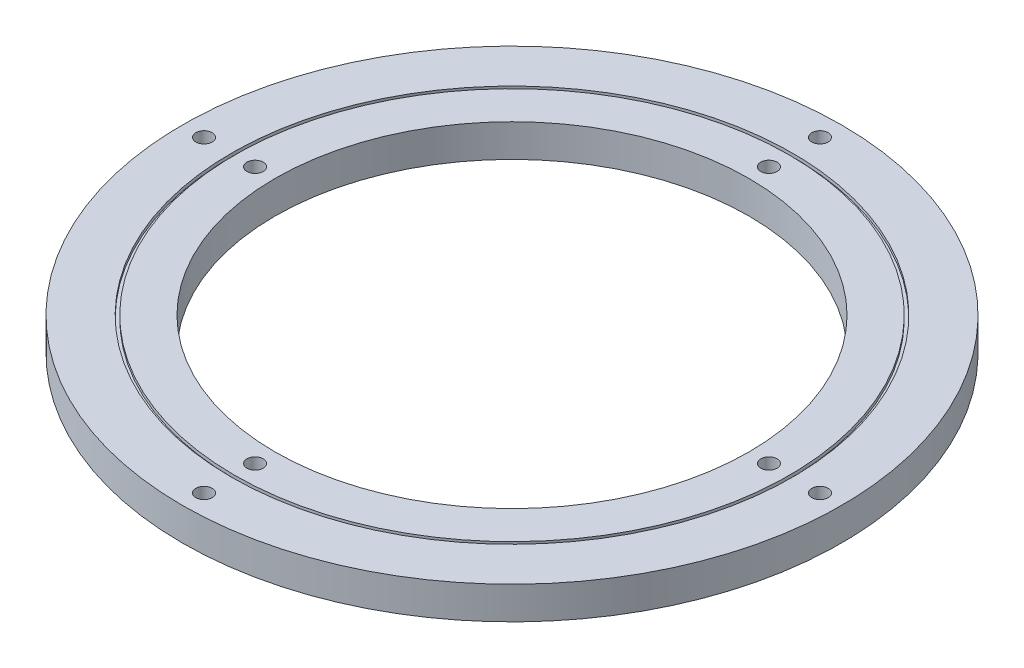
ISO-10303-21;
HEADER;
FILE_DESCRIPTION(('STEP AP214'),'2;1');
FILE_NAME('part.step','',(''),(''),'','','');
FILE_SCHEMA(('AUTOMOTIVE_DESIGN { 1 0 10303 214 1 1 1 1 }'));
ENDSEC;
DATA;
#1=APPLICATION_CONTEXT('core data for automotive mechanical design processes');
#2=APPLICATION_PROTOCOL_DEFINITION('international standard','automotive_design',2000,#1);
#3=PRODUCT_CONTEXT('',#1,'mechanical');
#4=PRODUCT('Part','Part','',(#3));
#5=PRODUCT_RELATED_PRODUCT_CATEGORY('part','',(#4));
#6=PRODUCT_DEFINITION_FORMATION('','',#4);
#7=PRODUCT_DEFINITION_CONTEXT('part definition',#1,'design');
#8=PRODUCT_DEFINITION('design','',#6,#7);
#9=PRODUCT_DEFINITION_SHAPE('','',#8);
#10=(LENGTH_UNIT() NAMED_UNIT(*) SI_UNIT(.MILLI.,.METRE.));
#11=(NAMED_UNIT(*) PLANE_ANGLE_UNIT() SI_UNIT($,.RADIAN.));
#12=(NAMED_UNIT(*) SI_UNIT($,.STERADIAN.) SOLID_ANGLE_UNIT());
#13=UNCERTAINTY_MEASURE_WITH_UNIT(LENGTH_MEASURE(1.E-05),#10,'distance_accuracy_value','');
#14=(GEOMETRIC_REPRESENTATION_CONTEXT(3) GLOBAL_UNCERTAINTY_ASSIGNED_CONTEXT((#13)) GLOBAL_UNIT_ASSIGNED_CONTEXT((#10,
#11,#12)) REPRESENTATION_CONTEXT('',''));
#15=CARTESIAN_POINT('',(0.,0.,0.));
#16=DIRECTION('',(0.,0.,1.));
#17=DIRECTION('',(1.,0.,0.));
#18=AXIS2_PLACEMENT_3D('',#15,#16,#17);
#19=CARTESIAN_POINT('',(0.,0.,0.));
#20=DIRECTION('',(0.,1.,0.));
#21=DIRECTION('',(0.,0.,1.));
#22=AXIS2_PLACEMENT_3D('',#19,#20,#21);
#23=PLANE('',#22);
#24=CARTESIAN_POINT('',(0.,0.,0.));
#25=DIRECTION('',(0.,1.,0.));
#26=DIRECTION('',(0.,0.,1.));
#27=AXIS2_PLACEMENT_3D('',#24,#25,#26);
#28=CIRCLE('',#27,72.6313);
#29=CARTESIAN_POINT('',(0.,0.,72.6313));
#30=VERTEX_POINT('',#29);
#31=EDGE_CURVE('E43',#30,#30,#28,.T.);
#32=ORIENTED_EDGE('',*,*,#31,.T.);
#33=EDGE_LOOP('',(#32));
#34=FACE_BOUND('',#33,.T.);
#35=CARTESIAN_POINT('',(2.64979010955457E-13,0.,-78.7635));
#36=DIRECTION('',(0.,1.,0.));
#37=DIRECTION('',(0.,0.,1.));
#38=AXIS2_PLACEMENT_3D('',#35,#36,#37);
#39=CIRCLE('',#38,2.50000000000001);
#40=CARTESIAN_POINT('',(2.64979010955457E-13,0.,-76.2635));
#41=VERTEX_POINT('',#40);
#42=EDGE_CURVE('E53',#41,#41,#39,.T.);
#43=ORIENTED_EDGE('',*,*,#42,.T.);
#44=EDGE_LOOP('',(#43));
#45=FACE_BOUND('',#44,.T.);
#46=CARTESIAN_POINT('',(-78.7635,0.,0.));
#47=DIRECTION('',(0.,1.,0.));
#48=DIRECTION('',(0.,0.,1.));
#49=AXIS2_PLACEMENT_3D('',#46,#47,#48);
#50=CIRCLE('',#49,2.50000000000001);
#51=CARTESIAN_POINT('',(-78.7635,0.,2.50000000000001));
#52=VERTEX_POINT('',#51);
#53=EDGE_CURVE('E59',#52,#52,#50,.T.);
#54=ORIENTED_EDGE('',*,*,#53,.T.);
#55=EDGE_LOOP('',(#54));
#56=FACE_BOUND('',#55,.T.);
#57=CARTESIAN_POINT('',(-8.13585310233123E-13,0.,78.7635));
#58=DIRECTION('',(0.,1.,0.));
#59=DIRECTION('',(0.,0.,1.));
#60=AXIS2_PLACEMENT_3D('',#57,#58,#59);
#61=CIRCLE('',#60,2.50000000000001);
#62=CARTESIAN_POINT('',(-8.13585310233123E-13,0.,81.2635));
#63=VERTEX_POINT('',#62);
#64=EDGE_CURVE('E79',#63,#63,#61,.T.);
#65=ORIENTED_EDGE('',*,*,#64,.T.);
#66=EDGE_LOOP('',(#65));
#67=FACE_BOUND('',#66,.T.);
#68=CARTESIAN_POINT('',(78.7635,0.,5.3776427755281E-13));
#69=DIRECTION('',(0.,1.,0.));
#70=DIRECTION('',(0.,0.,1.));
#71=AXIS2_PLACEMENT_3D('',#68,#69,#70);
#72=CIRCLE('',#71,2.50000000000001);
#73=CARTESIAN_POINT('',(78.7635,0.,2.50000000000055));
#74=VERTEX_POINT('',#73);
#75=EDGE_CURVE('E67',#74,#74,#72,.T.);
#76=ORIENTED_EDGE('',*,*,#75,.T.);
#77=EDGE_LOOP('',(#76));
#78=FACE_BOUND('',#77,.T.);
#79=CARTESIAN_POINT('',(0.,0.,0.));
#80=DIRECTION('',(0.,1.,0.));
#81=DIRECTION('',(0.,0.,1.));
#82=AXIS2_PLACEMENT_3D('',#79,#80,#81);
#83=CIRCLE('',#82,85.0285);
#84=CARTESIAN_POINT('',(0.,0.,85.0285));
#85=VERTEX_POINT('',#84);
#86=EDGE_CURVE('E115',#85,#85,#83,.T.);
#87=ORIENTED_EDGE('',*,*,#86,.F.);
#88=EDGE_LOOP('',(#87));
#89=FACE_BOUND('',#88,.T.);
#90=ADVANCED_FACE('F30',(#34,#45,#56,#67,#78,#89),#23,.F.);
#91=CARTESIAN_POINT('',(0.,10.,0.));
#92=DIRECTION('',(0.,1.,0.));
#93=DIRECTION('',(0.,0.,1.));
#94=AXIS2_PLACEMENT_3D('',#91,#92,#93);
#95=PLANE('',#94);
#96=CARTESIAN_POINT('',(0.,10.,0.));
#97=DIRECTION('',(0.,1.,0.));
#98=DIRECTION('',(0.,0.,1.));
#99=AXIS2_PLACEMENT_3D('',#96,#97,#98);
#100=CIRCLE('',#99,72.6313);
#101=CARTESIAN_POINT('',(0.,10.,72.6313));
#102=VERTEX_POINT('',#101);
#103=EDGE_CURVE('E41',#102,#102,#100,.T.);
#104=ORIENTED_EDGE('',*,*,#103,.F.);
#105=EDGE_LOOP('',(#104));
#106=FACE_BOUND('',#105,.T.);
#107=CARTESIAN_POINT('',(2.64979010955457E-13,10.,-78.7635));
#108=DIRECTION('',(0.,1.,0.));
#109=DIRECTION('',(0.,0.,1.));
#110=AXIS2_PLACEMENT_3D('',#107,#108,#109);
#111=CIRCLE('',#110,2.50000000000001);
#112=CARTESIAN_POINT('',(2.64979010955457E-13,10.,-76.2635));
#113=VERTEX_POINT('',#112);
#114=EDGE_CURVE('E70',#113,#113,#111,.T.);
#115=ORIENTED_EDGE('',*,*,#114,.F.);
#116=EDGE_LOOP('',(#115));
#117=FACE_BOUND('',#116,.T.);
#118=CARTESIAN_POINT('',(-78.7635,10.,0.));
#119=DIRECTION('',(0.,1.,0.));
#120=DIRECTION('',(0.,0.,1.));
#121=AXIS2_PLACEMENT_3D('',#118,#119,#120);
#122=CIRCLE('',#121,2.50000000000001);
#123=CARTESIAN_POINT('',(-78.7635,10.,2.50000000000001));
#124=VERTEX_POINT('',#123);
#125=EDGE_CURVE('E56',#124,#124,#122,.T.);
#126=ORIENTED_EDGE('',*,*,#125,.F.);
#127=EDGE_LOOP('',(#126));
#128=FACE_BOUND('',#127,.T.);
#129=CARTESIAN_POINT('',(-8.13585310233123E-13,10.,78.7635));
#130=DIRECTION('',(0.,1.,0.));
#131=DIRECTION('',(0.,0.,1.));
#132=AXIS2_PLACEMENT_3D('',#129,#130,#131);
#133=CIRCLE('',#132,2.50000000000001);
#134=CARTESIAN_POINT('',(-8.13585310233123E-13,10.,81.2635));
#135=VERTEX_POINT('',#134);
#136=EDGE_CURVE('E87',#135,#135,#133,.T.);
#137=ORIENTED_EDGE('',*,*,#136,.F.);
#138=EDGE_LOOP('',(#137));
#139=FACE_BOUND('',#138,.T.);
#140=CARTESIAN_POINT('',(78.7635,10.,5.3776427755281E-13));
#141=DIRECTION('',(0.,1.,0.));
#142=DIRECTION('',(0.,0.,1.));
#143=AXIS2_PLACEMENT_3D('',#140,#141,#142);
#144=CIRCLE('',#143,2.50000000000001);
#145=CARTESIAN_POINT('',(78.7635,10.,2.50000000000055));
#146=VERTEX_POINT('',#145);
#147=EDGE_CURVE('E82',#146,#146,#144,.T.);
#148=ORIENTED_EDGE('',*,*,#147,.F.);
#149=EDGE_LOOP('',(#148));
#150=FACE_BOUND('',#149,.T.);
#151=CARTESIAN_POINT('',(0.,10.,0.));
#152=DIRECTION('',(0.,1.,0.));
#153=DIRECTION('',(0.,0.,1.));
#154=AXIS2_PLACEMENT_3D('',#151,#152,#153);
#155=CIRCLE('',#154,85.0285);
#156=CARTESIAN_POINT('',(0.,10.,85.0285));
#157=VERTEX_POINT('',#156);
#158=EDGE_CURVE('E103',#157,#157,#155,.T.);
#159=ORIENTED_EDGE('',*,*,#158,.T.);
#160=EDGE_LOOP('',(#159));
#161=FACE_BOUND('',#160,.T.);
#162=ADVANCED_FACE('F131',(#106,#117,#128,#139,#150,#161),#95,.T.);
#163=CARTESIAN_POINT('',(0.,10.,0.));
#164=DIRECTION('',(0.,1.,0.));
#165=DIRECTION('',(0.,0.,1.));
#166=AXIS2_PLACEMENT_3D('',#163,#164,#165);
#167=CIRCLE('',#166,86.0285);
#168=CARTESIAN_POINT('',(0.,10.,86.0285));
#169=VERTEX_POINT('',#168);
#170=EDGE_CURVE('E97',#169,#169,#167,.T.);
#171=ORIENTED_EDGE('',*,*,#170,.F.);
#172=EDGE_LOOP('',(#171));
#173=FACE_BOUND('',#172,.T.);
#174=CARTESIAN_POINT('',(-94.4137,10.,0.));
#175=DIRECTION('',(0.,1.,0.));
#176=DIRECTION('',(0.,0.,1.));
#177=AXIS2_PLACEMENT_3D('',#174,#175,#176);
#178=CIRCLE('',#177,2.50000000000001);
#179=CARTESIAN_POINT('',(-94.4137,10.,2.50000000000001));
#180=VERTEX_POINT('',#179);
#181=EDGE_CURVE('E62',#180,#180,#178,.T.);
#182=ORIENTED_EDGE('',*,*,#181,.F.);
#183=EDGE_LOOP('',(#182));
#184=FACE_BOUND('',#183,.T.);
#185=CARTESIAN_POINT('',(-9.8879238130678E-13,10.,94.4137));
#186=DIRECTION('',(0.,1.,0.));
#187=DIRECTION('',(0.,0.,1.));
#188=AXIS2_PLACEMENT_3D('',#185,#186,#187);
#189=CIRCLE('',#188,2.50000000000001);
#190=CARTESIAN_POINT('',(-9.8879238130678E-13,10.,96.9137));
#191=VERTEX_POINT('',#190);
#192=EDGE_CURVE('E75',#191,#191,#189,.T.);
#193=ORIENTED_EDGE('',*,*,#192,.F.);
#194=EDGE_LOOP('',(#193));
#195=FACE_BOUND('',#194,.T.);
#196=CARTESIAN_POINT('',(3.29597460435593E-13,10.,-94.4137));
#197=DIRECTION('',(0.,1.,0.));
#198=DIRECTION('',(0.,0.,1.));
#199=AXIS2_PLACEMENT_3D('',#196,#197,#198);
#200=CIRCLE('',#199,2.50000000000001);
#201=CARTESIAN_POINT('',(3.29597460435593E-13,10.,-91.9137));
#202=VERTEX_POINT('',#201);
#203=EDGE_CURVE('E49',#202,#202,#200,.T.);
#204=ORIENTED_EDGE('',*,*,#203,.F.);
#205=EDGE_LOOP('',(#204));
#206=FACE_BOUND('',#205,.T.);
#207=CARTESIAN_POINT('',(94.4137,10.,6.59194920871187E-13));
#208=DIRECTION('',(0.,1.,0.));
#209=DIRECTION('',(0.,0.,1.));
#210=AXIS2_PLACEMENT_3D('',#207,#208,#209);
#211=CIRCLE('',#210,2.50000000000001);
#212=CARTESIAN_POINT('',(94.4137,10.,2.50000000000067));
#213=VERTEX_POINT('',#212);
#214=EDGE_CURVE('E63',#213,#213,#211,.T.);
#215=ORIENTED_EDGE('',*,*,#214,.F.);
#216=EDGE_LOOP('',(#215));
#217=FACE_BOUND('',#216,.T.);
#218=CARTESIAN_POINT('',(0.,10.,0.));
#219=DIRECTION('',(0.,1.,0.));
#220=DIRECTION('',(0.,0.,1.));
#221=AXIS2_PLACEMENT_3D('',#218,#219,#220);
#222=CIRCLE('',#221,101.0285);
#223=CARTESIAN_POINT('',(0.,10.,101.0285));
#224=VERTEX_POINT('',#223);
#225=EDGE_CURVE('E10',#224,#224,#222,.T.);
#226=ORIENTED_EDGE('',*,*,#225,.T.);
#227=EDGE_LOOP('',(#226));
#228=FACE_BOUND('',#227,.T.);
#229=ADVANCED_FACE('F139',(#173,#184,#195,#206,#217,#228),#95,.T.);
#230=CARTESIAN_POINT('',(0.,0.,0.));
#231=DIRECTION('',(0.,1.,0.));
#232=DIRECTION('',(0.,0.,1.));
#233=AXIS2_PLACEMENT_3D('',#230,#231,#232);
#234=CIRCLE('',#233,86.0285);
#235=CARTESIAN_POINT('',(0.,0.,86.0285));
#236=VERTEX_POINT('',#235);
#237=EDGE_CURVE('E109',#236,#236,#234,.T.);
#238=ORIENTED_EDGE('',*,*,#237,.T.);
#239=EDGE_LOOP('',(#238));
#240=FACE_BOUND('',#239,.T.);
#241=CARTESIAN_POINT('',(-94.4137,0.,0.));
#242=DIRECTION('',(0.,1.,0.));
#243=DIRECTION('',(0.,0.,1.));
#244=AXIS2_PLACEMENT_3D('',#241,#242,#243);
#245=CIRCLE('',#244,2.50000000000001);
#246=CARTESIAN_POINT('',(-94.4137,0.,2.50000000000001));
#247=VERTEX_POINT('',#246);
#248=EDGE_CURVE('E46',#247,#247,#245,.T.);
#249=ORIENTED_EDGE('',*,*,#248,.T.);
#250=EDGE_LOOP('',(#249));
#251=FACE_BOUND('',#250,.T.);
#252=CARTESIAN_POINT('',(-9.8879238130678E-13,0.,94.4137));
#253=DIRECTION('',(0.,1.,0.));
#254=DIRECTION('',(0.,0.,1.));
#255=AXIS2_PLACEMENT_3D('',#252,#253,#254);
#256=CIRCLE('',#255,2.50000000000001);
#257=CARTESIAN_POINT('',(-9.8879238130678E-13,0.,96.9137));
#258=VERTEX_POINT('',#257);
#259=EDGE_CURVE('E78',#258,#258,#256,.T.);
#260=ORIENTED_EDGE('',*,*,#259,.T.);
#261=EDGE_LOOP('',(#260));
#262=FACE_BOUND('',#261,.T.);
#263=CARTESIAN_POINT('',(3.29597460435593E-13,0.,-94.4137));
#264=DIRECTION('',(0.,1.,0.));
#265=DIRECTION('',(0.,0.,1.));
#266=AXIS2_PLACEMENT_3D('',#263,#264,#265);
#267=CIRCLE('',#266,2.50000000000001);
#268=CARTESIAN_POINT('',(3.29597460435593E-13,0.,-91.9137));
#269=VERTEX_POINT('',#268);
#270=EDGE_CURVE('E52',#269,#269,#267,.T.);
#271=ORIENTED_EDGE('',*,*,#270,.T.);
#272=EDGE_LOOP('',(#271));
#273=FACE_BOUND('',#272,.T.);
#274=CARTESIAN_POINT('',(94.4137,0.,6.59194920871187E-13));
#275=DIRECTION('',(0.,1.,0.));
#276=DIRECTION('',(0.,0.,1.));
#277=AXIS2_PLACEMENT_3D('',#274,#275,#276);
#278=CIRCLE('',#277,2.50000000000001);
#279=CARTESIAN_POINT('',(94.4137,0.,2.50000000000067));
#280=VERTEX_POINT('',#279);
#281=EDGE_CURVE('E66',#280,#280,#278,.T.);
#282=ORIENTED_EDGE('',*,*,#281,.T.);
#283=EDGE_LOOP('',(#282));
#284=FACE_BOUND('',#283,.T.);
#285=CARTESIAN_POINT('',(0.,0.,0.));
#286=DIRECTION('',(0.,1.,0.));
#287=DIRECTION('',(0.,0.,1.));
#288=AXIS2_PLACEMENT_3D('',#285,#286,#287);
#289=CIRCLE('',#288,101.0285);
#290=CARTESIAN_POINT('',(0.,0.,101.0285));
#291=VERTEX_POINT('',#290);
#292=EDGE_CURVE('E34',#291,#291,#289,.T.);
#293=ORIENTED_EDGE('',*,*,#292,.F.);
#294=EDGE_LOOP('',(#293));
#295=FACE_BOUND('',#294,.T.);
#296=ADVANCED_FACE('F133',(#240,#251,#262,#273,#284,#295),#23,.F.);
#297=CARTESIAN_POINT('',(0.,10.,0.));
#298=DIRECTION('',(0.,-1.,0.));
#299=DIRECTION('',(0.,0.,-1.));
#300=AXIS2_PLACEMENT_3D('',#297,#298,#299);
#301=CYLINDRICAL_SURFACE('',#300,101.0285);
#302=ORIENTED_EDGE('',*,*,#225,.F.);
#303=EDGE_LOOP('',(#302));
#304=FACE_BOUND('',#303,.T.);
#305=ORIENTED_EDGE('',*,*,#292,.T.);
#306=EDGE_LOOP('',(#305));
#307=FACE_BOUND('',#306,.T.);
#308=ADVANCED_FACE('F32',(#304,#307),#301,.T.);
#309=CARTESIAN_POINT('',(0.,10.,0.));
#310=DIRECTION('',(0.,-1.,0.));
#311=DIRECTION('',(0.,0.,-1.));
#312=AXIS2_PLACEMENT_3D('',#309,#310,#311);
#313=CYLINDRICAL_SURFACE('',#312,72.6313);
#314=ORIENTED_EDGE('',*,*,#103,.T.);
#315=EDGE_LOOP('',(#314));
#316=FACE_BOUND('',#315,.T.);
#317=ORIENTED_EDGE('',*,*,#31,.F.);
#318=EDGE_LOOP('',(#317));
#319=FACE_BOUND('',#318,.T.);
#320=ADVANCED_FACE('F148',(#316,#319),#313,.F.);
#321=CARTESIAN_POINT('',(94.4137,0.,6.59194920871187E-13));
#322=DIRECTION('',(0.,1.,0.));
#323=DIRECTION('',(0.,0.,1.));
#324=AXIS2_PLACEMENT_3D('',#321,#322,#323);
#325=CYLINDRICAL_SURFACE('',#324,2.50000000000001);
#326=ORIENTED_EDGE('',*,*,#281,.F.);
#327=EDGE_LOOP('',(#326));
#328=FACE_BOUND('',#327,.T.);
#329=ORIENTED_EDGE('',*,*,#214,.T.);
#330=EDGE_LOOP('',(#329));
#331=FACE_BOUND('',#330,.T.);
#332=ADVANCED_FACE('F165',(#328,#331),#325,.F.);
#333=CARTESIAN_POINT('',(2.64979010955457E-13,0.,-78.7635));
#334=DIRECTION('',(0.,1.,0.));
#335=DIRECTION('',(0.,0.,1.));
#336=AXIS2_PLACEMENT_3D('',#333,#334,#335);
#337=CYLINDRICAL_SURFACE('',#336,2.50000000000001);
#338=ORIENTED_EDGE('',*,*,#42,.F.);
#339=EDGE_LOOP('',(#338));
#340=FACE_BOUND('',#339,.T.);
#341=ORIENTED_EDGE('',*,*,#114,.T.);
#342=EDGE_LOOP('',(#341));
#343=FACE_BOUND('',#342,.T.);
#344=ADVANCED_FACE('F168',(#340,#343),#337,.F.);
#345=CARTESIAN_POINT('',(3.29597460435593E-13,0.,-94.4137));
#346=DIRECTION('',(0.,1.,0.));
#347=DIRECTION('',(0.,0.,1.));
#348=AXIS2_PLACEMENT_3D('',#345,#346,#347);
#349=CYLINDRICAL_SURFACE('',#348,2.50000000000001);
#350=ORIENTED_EDGE('',*,*,#270,.F.);
#351=EDGE_LOOP('',(#350));
#352=FACE_BOUND('',#351,.T.);
#353=ORIENTED_EDGE('',*,*,#203,.T.);
#354=EDGE_LOOP('',(#353));
#355=FACE_BOUND('',#354,.T.);
#356=ADVANCED_FACE('F176',(#352,#355),#349,.F.);
#357=CARTESIAN_POINT('',(-78.7635,0.,0.));
#358=DIRECTION('',(0.,1.,0.));
#359=DIRECTION('',(0.,0.,1.));
#360=AXIS2_PLACEMENT_3D('',#357,#358,#359);
#361=CYLINDRICAL_SURFACE('',#360,2.50000000000001);
#362=ORIENTED_EDGE('',*,*,#53,.F.);
#363=EDGE_LOOP('',(#362));
#364=FACE_BOUND('',#363,.T.);
#365=ORIENTED_EDGE('',*,*,#125,.T.);
#366=EDGE_LOOP('',(#365));
#367=FACE_BOUND('',#366,.T.);
#368=ADVANCED_FACE('F183',(#364,#367),#361,.F.);
#369=CARTESIAN_POINT('',(-8.13585310233123E-13,0.,78.7635));
#370=DIRECTION('',(0.,1.,0.));
#371=DIRECTION('',(0.,0.,1.));
#372=AXIS2_PLACEMENT_3D('',#369,#370,#371);
#373=CYLINDRICAL_SURFACE('',#372,2.50000000000001);
#374=ORIENTED_EDGE('',*,*,#64,.F.);
#375=EDGE_LOOP('',(#374));
#376=FACE_BOUND('',#375,.T.);
#377=ORIENTED_EDGE('',*,*,#136,.T.);
#378=EDGE_LOOP('',(#377));
#379=FACE_BOUND('',#378,.T.);
#380=ADVANCED_FACE('F186',(#376,#379),#373,.F.);
#381=CARTESIAN_POINT('',(-9.8879238130678E-13,0.,94.4137));
#382=DIRECTION('',(0.,1.,0.));
#383=DIRECTION('',(0.,0.,1.));
#384=AXIS2_PLACEMENT_3D('',#381,#382,#383);
#385=CYLINDRICAL_SURFACE('',#384,2.50000000000001);
#386=ORIENTED_EDGE('',*,*,#259,.F.);
#387=EDGE_LOOP('',(#386));
#388=FACE_BOUND('',#387,.T.);
#389=ORIENTED_EDGE('',*,*,#192,.T.);
#390=EDGE_LOOP('',(#389));
#391=FACE_BOUND('',#390,.T.);
#392=ADVANCED_FACE('F207',(#388,#391),#385,.F.);
#393=CARTESIAN_POINT('',(78.7635,0.,5.3776427755281E-13));
#394=DIRECTION('',(0.,1.,0.));
#395=DIRECTION('',(0.,0.,1.));
#396=AXIS2_PLACEMENT_3D('',#393,#394,#395);
#397=CYLINDRICAL_SURFACE('',#396,2.50000000000001);
#398=ORIENTED_EDGE('',*,*,#75,.F.);
#399=EDGE_LOOP('',(#398));
#400=FACE_BOUND('',#399,.T.);
#401=ORIENTED_EDGE('',*,*,#147,.T.);
#402=EDGE_LOOP('',(#401));
#403=FACE_BOUND('',#402,.T.);
#404=ADVANCED_FACE('F215',(#400,#403),#397,.F.);
#405=CARTESIAN_POINT('',(-94.4137,0.,0.));
#406=DIRECTION('',(0.,1.,0.));
#407=DIRECTION('',(0.,0.,1.));
#408=AXIS2_PLACEMENT_3D('',#405,#406,#407);
#409=CYLINDRICAL_SURFACE('',#408,2.50000000000001);
#410=ORIENTED_EDGE('',*,*,#248,.F.);
#411=EDGE_LOOP('',(#410));
#412=FACE_BOUND('',#411,.T.);
#413=ORIENTED_EDGE('',*,*,#181,.T.);
#414=EDGE_LOOP('',(#413));
#415=FACE_BOUND('',#414,.T.);
#416=ADVANCED_FACE('F222',(#412,#415),#409,.F.);
#417=CARTESIAN_POINT('',(0.,9.,0.));
#418=DIRECTION('',(0.,1.,0.));
#419=DIRECTION('',(0.,0.,1.));
#420=AXIS2_PLACEMENT_3D('',#417,#418,#419);
#421=CYLINDRICAL_SURFACE('',#420,86.0285);
#422=CARTESIAN_POINT('',(0.,9.,0.));
#423=DIRECTION('',(0.,1.,0.));
#424=DIRECTION('',(0.,0.,1.));
#425=AXIS2_PLACEMENT_3D('',#422,#423,#424);
#426=CIRCLE('',#425,86.0285);
#427=CARTESIAN_POINT('',(0.,9.,86.0285));
#428=VERTEX_POINT('',#427);
#429=EDGE_CURVE('E90',#428,#428,#426,.T.);
#430=ORIENTED_EDGE('',*,*,#429,.F.);
#431=EDGE_LOOP('',(#430));
#432=FACE_BOUND('',#431,.T.);
#433=ORIENTED_EDGE('',*,*,#170,.T.);
#434=EDGE_LOOP('',(#433));
#435=FACE_BOUND('',#434,.T.);
#436=ADVANCED_FACE('F230',(#432,#435),#421,.F.);
#437=CARTESIAN_POINT('',(0.,9.,0.));
#438=DIRECTION('',(0.,1.,0.));
#439=DIRECTION('',(0.,0.,1.));
#440=AXIS2_PLACEMENT_3D('',#437,#438,#439);
#441=PLANE('',#440);
#442=CARTESIAN_POINT('',(0.,9.,0.));
#443=DIRECTION('',(0.,1.,0.));
#444=DIRECTION('',(0.,0.,1.));
#445=AXIS2_PLACEMENT_3D('',#442,#443,#444);
#446=CIRCLE('',#445,85.0285);
#447=CARTESIAN_POINT('',(0.,9.,85.0285));
#448=VERTEX_POINT('',#447);
#449=EDGE_CURVE('E100',#448,#448,#446,.T.);
#450=ORIENTED_EDGE('',*,*,#449,.F.);
#451=EDGE_LOOP('',(#450));
#452=FACE_BOUND('',#451,.T.);
#453=ORIENTED_EDGE('',*,*,#429,.T.);
#454=EDGE_LOOP('',(#453));
#455=FACE_BOUND('',#454,.T.);
#456=ADVANCED_FACE('F250',(#452,#455),#441,.T.);
#457=CARTESIAN_POINT('',(0.,9.,0.));
#458=DIRECTION('',(0.,1.,0.));
#459=DIRECTION('',(0.,0.,1.));
#460=AXIS2_PLACEMENT_3D('',#457,#458,#459);
#461=CYLINDRICAL_SURFACE('',#460,85.0285);
#462=ORIENTED_EDGE('',*,*,#449,.T.);
#463=EDGE_LOOP('',(#462));
#464=FACE_BOUND('',#463,.T.);
#465=ORIENTED_EDGE('',*,*,#158,.F.);
#466=EDGE_LOOP('',(#465));
#467=FACE_BOUND('',#466,.T.);
#468=ADVANCED_FACE('F257',(#464,#467),#461,.T.);
#469=CARTESIAN_POINT('',(0.,1.,0.));
#470=DIRECTION('',(0.,-1.,0.));
#471=DIRECTION('',(0.,0.,1.));
#472=AXIS2_PLACEMENT_3D('',#469,#470,#471);
#473=PLANE('',#472);
#474=CARTESIAN_POINT('',(0.,1.,0.));
#475=DIRECTION('',(0.,1.,0.));
#476=DIRECTION('',(0.,0.,1.));
#477=AXIS2_PLACEMENT_3D('',#474,#475,#476);
#478=CIRCLE('',#477,86.0285);
#479=CARTESIAN_POINT('',(0.,1.,86.0285));
#480=VERTEX_POINT('',#479);
#481=EDGE_CURVE('E106',#480,#480,#478,.T.);
#482=ORIENTED_EDGE('',*,*,#481,.F.);
#483=EDGE_LOOP('',(#482));
#484=FACE_BOUND('',#483,.T.);
#485=CARTESIAN_POINT('',(0.,1.,0.));
#486=DIRECTION('',(0.,1.,0.));
#487=DIRECTION('',(0.,0.,1.));
#488=AXIS2_PLACEMENT_3D('',#485,#486,#487);
#489=CIRCLE('',#488,85.0285);
#490=CARTESIAN_POINT('',(0.,1.,85.0285));
#491=VERTEX_POINT('',#490);
#492=EDGE_CURVE('E112',#491,#491,#489,.T.);
#493=ORIENTED_EDGE('',*,*,#492,.T.);
#494=EDGE_LOOP('',(#493));
#495=FACE_BOUND('',#494,.T.);
#496=ADVANCED_FACE('F121',(#484,#495),#473,.T.);
#497=CARTESIAN_POINT('',(0.,1.,0.));
#498=DIRECTION('',(0.,-1.,0.));
#499=DIRECTION('',(0.,0.,-1.));
#500=AXIS2_PLACEMENT_3D('',#497,#498,#499);
#501=CYLINDRICAL_SURFACE('',#500,86.0285);
#502=ORIENTED_EDGE('',*,*,#481,.T.);
#503=EDGE_LOOP('',(#502));
#504=FACE_BOUND('',#503,.T.);
#505=ORIENTED_EDGE('',*,*,#237,.F.);
#506=EDGE_LOOP('',(#505));
#507=FACE_BOUND('',#506,.T.);
#508=ADVANCED_FACE('F126',(#504,#507),#501,.F.);
#509=CARTESIAN_POINT('',(0.,1.,0.));
#510=DIRECTION('',(0.,-1.,0.));
#511=DIRECTION('',(0.,0.,-1.));
#512=AXIS2_PLACEMENT_3D('',#509,#510,#511);
#513=CYLINDRICAL_SURFACE('',#512,85.0285);
#514=ORIENTED_EDGE('',*,*,#492,.F.);
#515=EDGE_LOOP('',(#514));
#516=FACE_BOUND('',#515,.T.);
#517=ORIENTED_EDGE('',*,*,#86,.T.);
#518=EDGE_LOOP('',(#517));
#519=FACE_BOUND('',#518,.T.);
#520=ADVANCED_FACE('F123',(#516,#519),#513,.T.);
#521=CLOSED_SHELL('',(#90,#162,#229,#296,#308,#320,#332,#344,#356,#368,#380,#392,#404,#416,#436,
#456,#468,#496,#508,#520));
#522=MANIFOLD_SOLID_BREP('B2',#521);
#523=ADVANCED_BREP_SHAPE_REPRESENTATION('',(#18,#522),#14);
#524=SHAPE_DEFINITION_REPRESENTATION(#9,#523);
ENDSEC;
END-ISO-10303-21;
